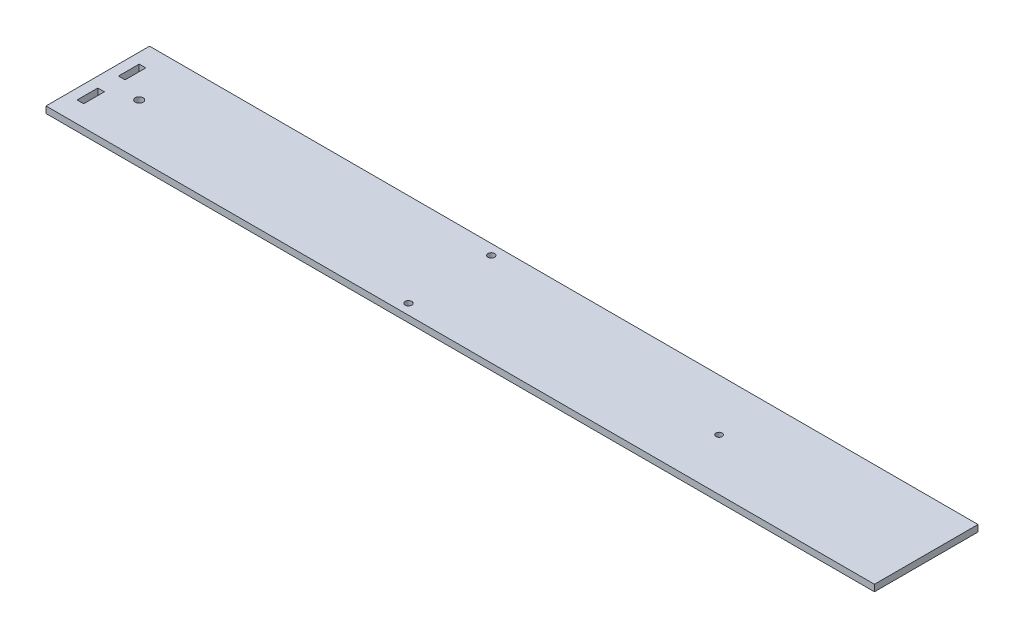
ISO-10303-21;
HEADER;
FILE_DESCRIPTION(('STEP AP214'),'2;1');
FILE_NAME('part.step','',(''),(''),'','','');
FILE_SCHEMA(('AUTOMOTIVE_DESIGN { 1 0 10303 214 1 1 1 1 }'));
ENDSEC;
DATA;
#1=APPLICATION_CONTEXT('core data for automotive mechanical design processes');
#2=APPLICATION_PROTOCOL_DEFINITION('international standard','automotive_design',2000,#1);
#3=PRODUCT_CONTEXT('',#1,'mechanical');
#4=PRODUCT('Part','Part','',(#3));
#5=PRODUCT_RELATED_PRODUCT_CATEGORY('part','',(#4));
#6=PRODUCT_DEFINITION_FORMATION('','',#4);
#7=PRODUCT_DEFINITION_CONTEXT('part definition',#1,'design');
#8=PRODUCT_DEFINITION('design','',#6,#7);
#9=PRODUCT_DEFINITION_SHAPE('','',#8);
#10=(LENGTH_UNIT() NAMED_UNIT(*) SI_UNIT(.MILLI.,.METRE.));
#11=(NAMED_UNIT(*) PLANE_ANGLE_UNIT() SI_UNIT($,.RADIAN.));
#12=(NAMED_UNIT(*) SI_UNIT($,.STERADIAN.) SOLID_ANGLE_UNIT());
#13=UNCERTAINTY_MEASURE_WITH_UNIT(LENGTH_MEASURE(1.E-05),#10,'distance_accuracy_value','');
#14=(GEOMETRIC_REPRESENTATION_CONTEXT(3) GLOBAL_UNCERTAINTY_ASSIGNED_CONTEXT((#13)) GLOBAL_UNIT_ASSIGNED_CONTEXT((#10,
#11,#12)) REPRESENTATION_CONTEXT('',''));
#15=CARTESIAN_POINT('',(0.,0.,0.));
#16=DIRECTION('',(0.,0.,1.));
#17=DIRECTION('',(1.,0.,0.));
#18=AXIS2_PLACEMENT_3D('',#15,#16,#17);
#19=CARTESIAN_POINT('',(0.,3.175,0.));
#20=DIRECTION('',(0.,-1.,0.));
#21=DIRECTION('',(0.,0.,-1.));
#22=AXIS2_PLACEMENT_3D('',#19,#20,#21);
#23=PLANE('',#22);
#24=CARTESIAN_POINT('',(300.,3.175,-25.));
#25=DIRECTION('',(0.,1.,0.));
#26=DIRECTION('',(0.,0.,1.));
#27=AXIS2_PLACEMENT_3D('',#24,#25,#26);
#28=CIRCLE('',#27,1.50000000000003);
#29=CARTESIAN_POINT('',(300.,3.175,-23.5));
#30=VERTEX_POINT('',#29);
#31=EDGE_CURVE('E162',#30,#30,#28,.T.);
#32=ORIENTED_EDGE('',*,*,#31,.F.);
#33=EDGE_LOOP('',(#32));
#34=FACE_BOUND('',#33,.T.);
#35=DIRECTION('',(0.,0.,1.));
#36=VECTOR('',#35,1.);
#37=CARTESIAN_POINT('',(5.,3.175,-20.));
#38=LINE('',#37,#36);
#39=CARTESIAN_POINT('',(5.,3.175,-20.));
#40=VERTEX_POINT('',#39);
#41=CARTESIAN_POINT('',(5.,3.175,-10.));
#42=VERTEX_POINT('',#41);
#43=EDGE_CURVE('E168',#40,#42,#38,.T.);
#44=ORIENTED_EDGE('',*,*,#43,.F.);
#45=DIRECTION('',(-1.,0.,0.));
#46=VECTOR('',#45,1.);
#47=CARTESIAN_POINT('',(8.175,3.175,-20.));
#48=LINE('',#47,#46);
#49=CARTESIAN_POINT('',(8.175,3.175,-20.));
#50=VERTEX_POINT('',#49);
#51=EDGE_CURVE('E176',#50,#40,#48,.T.);
#52=ORIENTED_EDGE('',*,*,#51,.F.);
#53=DIRECTION('',(0.,0.,-1.));
#54=VECTOR('',#53,1.);
#55=CARTESIAN_POINT('',(8.175,3.175,-10.));
#56=LINE('',#55,#54);
#57=CARTESIAN_POINT('',(8.175,3.175,-10.));
#58=VERTEX_POINT('',#57);
#59=EDGE_CURVE('E173',#58,#50,#56,.T.);
#60=ORIENTED_EDGE('',*,*,#59,.F.);
#61=DIRECTION('',(1.,0.,0.));
#62=VECTOR('',#61,1.);
#63=CARTESIAN_POINT('',(5.,3.175,-10.));
#64=LINE('',#63,#62);
#65=EDGE_CURVE('E170',#42,#58,#64,.T.);
#66=ORIENTED_EDGE('',*,*,#65,.F.);
#67=EDGE_LOOP('',(#44,#52,#60,#66));
#68=FACE_BOUND('',#67,.T.);
#69=DIRECTION('',(0.,0.,1.));
#70=VECTOR('',#69,1.);
#71=CARTESIAN_POINT('',(0.,3.175,0.));
#72=LINE('',#71,#70);
#73=CARTESIAN_POINT('',(0.,3.175,-50.));
#74=VERTEX_POINT('',#73);
#75=CARTESIAN_POINT('',(0.,3.175,0.));
#76=VERTEX_POINT('',#75);
#77=EDGE_CURVE('E199',#74,#76,#72,.T.);
#78=ORIENTED_EDGE('',*,*,#77,.T.);
#79=DIRECTION('',(1.,0.,0.));
#80=VECTOR('',#79,1.);
#81=CARTESIAN_POINT('',(0.,3.175,0.));
#82=LINE('',#81,#80);
#83=CARTESIAN_POINT('',(400.,3.175,0.));
#84=VERTEX_POINT('',#83);
#85=EDGE_CURVE('E202',#76,#84,#82,.T.);
#86=ORIENTED_EDGE('',*,*,#85,.T.);
#87=DIRECTION('',(0.,0.,-1.));
#88=VECTOR('',#87,1.);
#89=CARTESIAN_POINT('',(400.,3.175,0.));
#90=LINE('',#89,#88);
#91=CARTESIAN_POINT('',(400.,3.175,-50.));
#92=VERTEX_POINT('',#91);
#93=EDGE_CURVE('E205',#84,#92,#90,.T.);
#94=ORIENTED_EDGE('',*,*,#93,.T.);
#95=DIRECTION('',(-1.,0.,0.));
#96=VECTOR('',#95,1.);
#97=CARTESIAN_POINT('',(0.,3.175,-50.));
#98=LINE('',#97,#96);
#99=EDGE_CURVE('E207',#92,#74,#98,.T.);
#100=ORIENTED_EDGE('',*,*,#99,.T.);
#101=EDGE_LOOP('',(#78,#86,#94,#100));
#102=FACE_BOUND('',#101,.T.);
#103=DIRECTION('',(0.,0.,1.));
#104=VECTOR('',#103,1.);
#105=CARTESIAN_POINT('',(4.99999999999993,3.175,-40.));
#106=LINE('',#105,#104);
#107=CARTESIAN_POINT('',(4.99999999999993,3.175,-40.));
#108=VERTEX_POINT('',#107);
#109=CARTESIAN_POINT('',(4.99999999999993,3.175,-30.));
#110=VERTEX_POINT('',#109);
#111=EDGE_CURVE('E123',#108,#110,#106,.T.);
#112=ORIENTED_EDGE('',*,*,#111,.F.);
#113=DIRECTION('',(-1.,0.,0.));
#114=VECTOR('',#113,1.);
#115=CARTESIAN_POINT('',(8.17499999999993,3.175,-40.));
#116=LINE('',#115,#114);
#117=CARTESIAN_POINT('',(8.17499999999993,3.175,-40.));
#118=VERTEX_POINT('',#117);
#119=EDGE_CURVE('E146',#118,#108,#116,.T.);
#120=ORIENTED_EDGE('',*,*,#119,.F.);
#121=DIRECTION('',(0.,0.,-1.));
#122=VECTOR('',#121,1.);
#123=CARTESIAN_POINT('',(8.17499999999993,3.175,-30.));
#124=LINE('',#123,#122);
#125=CARTESIAN_POINT('',(8.17499999999993,3.175,-30.));
#126=VERTEX_POINT('',#125);
#127=EDGE_CURVE('E144',#126,#118,#124,.T.);
#128=ORIENTED_EDGE('',*,*,#127,.F.);
#129=DIRECTION('',(1.,0.,0.));
#130=VECTOR('',#129,1.);
#131=CARTESIAN_POINT('',(4.99999999999993,3.175,-30.));
#132=LINE('',#131,#130);
#133=EDGE_CURVE('E131',#110,#126,#132,.T.);
#134=ORIENTED_EDGE('',*,*,#133,.F.);
#135=EDGE_LOOP('',(#112,#120,#128,#134));
#136=FACE_BOUND('',#135,.T.);
#137=CARTESIAN_POINT('',(170.,3.175,-45.));
#138=DIRECTION('',(0.,1.,0.));
#139=DIRECTION('',(0.,0.,1.));
#140=AXIS2_PLACEMENT_3D('',#137,#138,#139);
#141=CIRCLE('',#140,1.59999999999999);
#142=CARTESIAN_POINT('',(170.,3.175,-43.4));
#143=VERTEX_POINT('',#142);
#144=EDGE_CURVE('E152',#143,#143,#141,.T.);
#145=ORIENTED_EDGE('',*,*,#144,.F.);
#146=EDGE_LOOP('',(#145));
#147=FACE_BOUND('',#146,.T.);
#148=CARTESIAN_POINT('',(170.,3.175,-5.));
#149=DIRECTION('',(0.,1.,0.));
#150=DIRECTION('',(0.,0.,1.));
#151=AXIS2_PLACEMENT_3D('',#148,#149,#150);
#152=CIRCLE('',#151,1.59999999999999);
#153=CARTESIAN_POINT('',(170.,3.175,-3.40000000000001));
#154=VERTEX_POINT('',#153);
#155=EDGE_CURVE('E334',#154,#154,#152,.T.);
#156=ORIENTED_EDGE('',*,*,#155,.F.);
#157=EDGE_LOOP('',(#156));
#158=FACE_BOUND('',#157,.T.);
#159=CARTESIAN_POINT('',(20.,3.175,-25.));
#160=DIRECTION('',(0.,1.,0.));
#161=DIRECTION('',(0.,0.,1.));
#162=AXIS2_PLACEMENT_3D('',#159,#160,#161);
#163=CIRCLE('',#162,1.9);
#164=CARTESIAN_POINT('',(20.,3.175,-23.1));
#165=VERTEX_POINT('',#164);
#166=EDGE_CURVE('E325',#165,#165,#163,.T.);
#167=ORIENTED_EDGE('',*,*,#166,.F.);
#168=EDGE_LOOP('',(#167));
#169=FACE_BOUND('',#168,.T.);
#170=ADVANCED_FACE('F34',(#34,#68,#102,#136,#147,#158,#169),#23,.F.);
#171=CARTESIAN_POINT('',(0.,0.,0.));
#172=DIRECTION('',(0.,-1.,0.));
#173=DIRECTION('',(0.,0.,-1.));
#174=AXIS2_PLACEMENT_3D('',#171,#172,#173);
#175=PLANE('',#174);
#176=CARTESIAN_POINT('',(170.,0.,-5.));
#177=DIRECTION('',(0.,1.,0.));
#178=DIRECTION('',(0.,0.,1.));
#179=AXIS2_PLACEMENT_3D('',#176,#177,#178);
#180=CIRCLE('',#179,1.59999999999999);
#181=CARTESIAN_POINT('',(170.,0.,-3.40000000000001));
#182=VERTEX_POINT('',#181);
#183=EDGE_CURVE('E331',#182,#182,#180,.T.);
#184=ORIENTED_EDGE('',*,*,#183,.T.);
#185=EDGE_LOOP('',(#184));
#186=FACE_BOUND('',#185,.T.);
#187=DIRECTION('',(-1.,0.,0.));
#188=VECTOR('',#187,1.);
#189=CARTESIAN_POINT('',(8.17499999999993,0.,-40.));
#190=LINE('',#189,#188);
#191=CARTESIAN_POINT('',(8.17499999999993,0.,-40.));
#192=VERTEX_POINT('',#191);
#193=CARTESIAN_POINT('',(4.99999999999993,0.,-40.));
#194=VERTEX_POINT('',#193);
#195=EDGE_CURVE('E132',#192,#194,#190,.T.);
#196=ORIENTED_EDGE('',*,*,#195,.T.);
#197=DIRECTION('',(0.,0.,1.));
#198=VECTOR('',#197,1.);
#199=CARTESIAN_POINT('',(4.99999999999993,0.,-40.));
#200=LINE('',#199,#198);
#201=CARTESIAN_POINT('',(4.99999999999993,0.,-30.));
#202=VERTEX_POINT('',#201);
#203=EDGE_CURVE('E57',#194,#202,#200,.T.);
#204=ORIENTED_EDGE('',*,*,#203,.T.);
#205=DIRECTION('',(1.,0.,0.));
#206=VECTOR('',#205,1.);
#207=CARTESIAN_POINT('',(4.99999999999993,0.,-30.));
#208=LINE('',#207,#206);
#209=CARTESIAN_POINT('',(8.17499999999993,0.,-30.));
#210=VERTEX_POINT('',#209);
#211=EDGE_CURVE('E138',#202,#210,#208,.T.);
#212=ORIENTED_EDGE('',*,*,#211,.T.);
#213=DIRECTION('',(0.,0.,-1.));
#214=VECTOR('',#213,1.);
#215=CARTESIAN_POINT('',(8.17499999999993,0.,-30.));
#216=LINE('',#215,#214);
#217=EDGE_CURVE('E154',#210,#192,#216,.T.);
#218=ORIENTED_EDGE('',*,*,#217,.T.);
#219=EDGE_LOOP('',(#196,#204,#212,#218));
#220=FACE_BOUND('',#219,.T.);
#221=CARTESIAN_POINT('',(300.,0.,-25.));
#222=DIRECTION('',(0.,1.,0.));
#223=DIRECTION('',(0.,0.,1.));
#224=AXIS2_PLACEMENT_3D('',#221,#222,#223);
#225=CIRCLE('',#224,1.50000000000003);
#226=CARTESIAN_POINT('',(300.,0.,-23.5));
#227=VERTEX_POINT('',#226);
#228=EDGE_CURVE('E139',#227,#227,#225,.T.);
#229=ORIENTED_EDGE('',*,*,#228,.T.);
#230=EDGE_LOOP('',(#229));
#231=FACE_BOUND('',#230,.T.);
#232=DIRECTION('',(0.,0.,1.));
#233=VECTOR('',#232,1.);
#234=CARTESIAN_POINT('',(0.,0.,0.));
#235=LINE('',#234,#233);
#236=CARTESIAN_POINT('',(0.,0.,-50.));
#237=VERTEX_POINT('',#236);
#238=CARTESIAN_POINT('',(0.,0.,0.));
#239=VERTEX_POINT('',#238);
#240=EDGE_CURVE('E198',#237,#239,#235,.T.);
#241=ORIENTED_EDGE('',*,*,#240,.F.);
#242=DIRECTION('',(-1.,0.,0.));
#243=VECTOR('',#242,1.);
#244=CARTESIAN_POINT('',(0.,0.,-50.));
#245=LINE('',#244,#243);
#246=CARTESIAN_POINT('',(400.,0.,-50.));
#247=VERTEX_POINT('',#246);
#248=EDGE_CURVE('E203',#247,#237,#245,.T.);
#249=ORIENTED_EDGE('',*,*,#248,.F.);
#250=DIRECTION('',(0.,0.,-1.));
#251=VECTOR('',#250,1.);
#252=CARTESIAN_POINT('',(400.,0.,0.));
#253=LINE('',#252,#251);
#254=CARTESIAN_POINT('',(400.,0.,0.));
#255=VERTEX_POINT('',#254);
#256=EDGE_CURVE('E214',#255,#247,#253,.T.);
#257=ORIENTED_EDGE('',*,*,#256,.F.);
#258=DIRECTION('',(1.,0.,0.));
#259=VECTOR('',#258,1.);
#260=CARTESIAN_POINT('',(0.,0.,0.));
#261=LINE('',#260,#259);
#262=EDGE_CURVE('E212',#239,#255,#261,.T.);
#263=ORIENTED_EDGE('',*,*,#262,.F.);
#264=EDGE_LOOP('',(#241,#249,#257,#263));
#265=FACE_BOUND('',#264,.T.);
#266=DIRECTION('',(-1.,0.,0.));
#267=VECTOR('',#266,1.);
#268=CARTESIAN_POINT('',(8.175,0.,-20.));
#269=LINE('',#268,#267);
#270=CARTESIAN_POINT('',(8.175,0.,-20.));
#271=VERTEX_POINT('',#270);
#272=CARTESIAN_POINT('',(5.,0.,-20.));
#273=VERTEX_POINT('',#272);
#274=EDGE_CURVE('E171',#271,#273,#269,.T.);
#275=ORIENTED_EDGE('',*,*,#274,.T.);
#276=DIRECTION('',(0.,0.,1.));
#277=VECTOR('',#276,1.);
#278=CARTESIAN_POINT('',(5.,0.,-20.));
#279=LINE('',#278,#277);
#280=CARTESIAN_POINT('',(5.,0.,-10.));
#281=VERTEX_POINT('',#280);
#282=EDGE_CURVE('E165',#273,#281,#279,.T.);
#283=ORIENTED_EDGE('',*,*,#282,.T.);
#284=DIRECTION('',(1.,0.,0.));
#285=VECTOR('',#284,1.);
#286=CARTESIAN_POINT('',(5.,0.,-10.));
#287=LINE('',#286,#285);
#288=CARTESIAN_POINT('',(8.175,0.,-10.));
#289=VERTEX_POINT('',#288);
#290=EDGE_CURVE('E181',#281,#289,#287,.T.);
#291=ORIENTED_EDGE('',*,*,#290,.T.);
#292=DIRECTION('',(0.,0.,-1.));
#293=VECTOR('',#292,1.);
#294=CARTESIAN_POINT('',(8.175,0.,-10.));
#295=LINE('',#294,#293);
#296=EDGE_CURVE('E184',#289,#271,#295,.T.);
#297=ORIENTED_EDGE('',*,*,#296,.T.);
#298=EDGE_LOOP('',(#275,#283,#291,#297));
#299=FACE_BOUND('',#298,.T.);
#300=CARTESIAN_POINT('',(170.,0.,-45.));
#301=DIRECTION('',(0.,1.,0.));
#302=DIRECTION('',(0.,0.,1.));
#303=AXIS2_PLACEMENT_3D('',#300,#301,#302);
#304=CIRCLE('',#303,1.59999999999999);
#305=CARTESIAN_POINT('',(170.,0.,-43.4));
#306=VERTEX_POINT('',#305);
#307=EDGE_CURVE('E337',#306,#306,#304,.T.);
#308=ORIENTED_EDGE('',*,*,#307,.T.);
#309=EDGE_LOOP('',(#308));
#310=FACE_BOUND('',#309,.T.);
#311=CARTESIAN_POINT('',(20.,0.,-25.));
#312=DIRECTION('',(0.,1.,0.));
#313=DIRECTION('',(0.,0.,1.));
#314=AXIS2_PLACEMENT_3D('',#311,#312,#313);
#315=CIRCLE('',#314,1.9);
#316=CARTESIAN_POINT('',(20.,0.,-23.1));
#317=VERTEX_POINT('',#316);
#318=EDGE_CURVE('E328',#317,#317,#315,.T.);
#319=ORIENTED_EDGE('',*,*,#318,.T.);
#320=EDGE_LOOP('',(#319));
#321=FACE_BOUND('',#320,.T.);
#322=ADVANCED_FACE('F232',(#186,#220,#231,#265,#299,#310,#321),#175,.T.);
#323=CARTESIAN_POINT('',(0.,3.175,0.));
#324=DIRECTION('',(1.,0.,0.));
#325=DIRECTION('',(0.,0.,-1.));
#326=AXIS2_PLACEMENT_3D('',#323,#324,#325);
#327=PLANE('',#326);
#328=ORIENTED_EDGE('',*,*,#240,.T.);
#329=DIRECTION('',(0.,-1.,0.));
#330=VECTOR('',#329,1.);
#331=CARTESIAN_POINT('',(0.,3.175,0.));
#332=LINE('',#331,#330);
#333=EDGE_CURVE('E11',#76,#239,#332,.T.);
#334=ORIENTED_EDGE('',*,*,#333,.F.);
#335=ORIENTED_EDGE('',*,*,#77,.F.);
#336=DIRECTION('',(0.,-1.,0.));
#337=VECTOR('',#336,1.);
#338=CARTESIAN_POINT('',(0.,3.175,-50.));
#339=LINE('',#338,#337);
#340=EDGE_CURVE('E209',#74,#237,#339,.T.);
#341=ORIENTED_EDGE('',*,*,#340,.T.);
#342=EDGE_LOOP('',(#328,#334,#335,#341));
#343=FACE_BOUND('',#342,.T.);
#344=ADVANCED_FACE('F36',(#343),#327,.F.);
#345=CARTESIAN_POINT('',(0.,3.175,0.));
#346=DIRECTION('',(0.,0.,-1.));
#347=DIRECTION('',(-1.,0.,0.));
#348=AXIS2_PLACEMENT_3D('',#345,#346,#347);
#349=PLANE('',#348);
#350=ORIENTED_EDGE('',*,*,#262,.T.);
#351=DIRECTION('',(0.,-1.,0.));
#352=VECTOR('',#351,1.);
#353=CARTESIAN_POINT('',(400.,3.175,0.));
#354=LINE('',#353,#352);
#355=EDGE_CURVE('E42',#84,#255,#354,.T.);
#356=ORIENTED_EDGE('',*,*,#355,.F.);
#357=ORIENTED_EDGE('',*,*,#85,.F.);
#358=ORIENTED_EDGE('',*,*,#333,.T.);
#359=EDGE_LOOP('',(#350,#356,#357,#358));
#360=FACE_BOUND('',#359,.T.);
#361=ADVANCED_FACE('F242',(#360),#349,.F.);
#362=CARTESIAN_POINT('',(400.,3.175,0.));
#363=DIRECTION('',(-1.,0.,0.));
#364=DIRECTION('',(0.,0.,1.));
#365=AXIS2_PLACEMENT_3D('',#362,#363,#364);
#366=PLANE('',#365);
#367=ORIENTED_EDGE('',*,*,#256,.T.);
#368=DIRECTION('',(0.,-1.,0.));
#369=VECTOR('',#368,1.);
#370=CARTESIAN_POINT('',(400.,3.175,-50.));
#371=LINE('',#370,#369);
#372=EDGE_CURVE('E219',#92,#247,#371,.T.);
#373=ORIENTED_EDGE('',*,*,#372,.F.);
#374=ORIENTED_EDGE('',*,*,#93,.F.);
#375=ORIENTED_EDGE('',*,*,#355,.T.);
#376=EDGE_LOOP('',(#367,#373,#374,#375));
#377=FACE_BOUND('',#376,.T.);
#378=ADVANCED_FACE('F226',(#377),#366,.F.);
#379=CARTESIAN_POINT('',(0.,3.175,-50.));
#380=DIRECTION('',(0.,0.,1.));
#381=DIRECTION('',(1.,0.,0.));
#382=AXIS2_PLACEMENT_3D('',#379,#380,#381);
#383=PLANE('',#382);
#384=ORIENTED_EDGE('',*,*,#248,.T.);
#385=ORIENTED_EDGE('',*,*,#340,.F.);
#386=ORIENTED_EDGE('',*,*,#99,.F.);
#387=ORIENTED_EDGE('',*,*,#372,.T.);
#388=EDGE_LOOP('',(#384,#385,#386,#387));
#389=FACE_BOUND('',#388,.T.);
#390=ADVANCED_FACE('F236',(#389),#383,.F.);
#391=CARTESIAN_POINT('',(5.,3.175,-20.));
#392=DIRECTION('',(1.,0.,0.));
#393=DIRECTION('',(0.,0.,-1.));
#394=AXIS2_PLACEMENT_3D('',#391,#392,#393);
#395=PLANE('',#394);
#396=ORIENTED_EDGE('',*,*,#282,.F.);
#397=DIRECTION('',(0.,-1.,0.));
#398=VECTOR('',#397,1.);
#399=CARTESIAN_POINT('',(5.,3.175,-20.));
#400=LINE('',#399,#398);
#401=EDGE_CURVE('E178',#40,#273,#400,.T.);
#402=ORIENTED_EDGE('',*,*,#401,.F.);
#403=ORIENTED_EDGE('',*,*,#43,.T.);
#404=DIRECTION('',(0.,-1.,0.));
#405=VECTOR('',#404,1.);
#406=CARTESIAN_POINT('',(5.,3.175,-10.));
#407=LINE('',#406,#405);
#408=EDGE_CURVE('E195',#42,#281,#407,.T.);
#409=ORIENTED_EDGE('',*,*,#408,.T.);
#410=EDGE_LOOP('',(#396,#402,#403,#409));
#411=FACE_BOUND('',#410,.T.);
#412=ADVANCED_FACE('F260',(#411),#395,.T.);
#413=CARTESIAN_POINT('',(5.,3.175,-10.));
#414=DIRECTION('',(0.,0.,-1.));
#415=DIRECTION('',(-1.,0.,0.));
#416=AXIS2_PLACEMENT_3D('',#413,#414,#415);
#417=PLANE('',#416);
#418=ORIENTED_EDGE('',*,*,#290,.F.);
#419=ORIENTED_EDGE('',*,*,#408,.F.);
#420=ORIENTED_EDGE('',*,*,#65,.T.);
#421=DIRECTION('',(0.,-1.,0.));
#422=VECTOR('',#421,1.);
#423=CARTESIAN_POINT('',(8.175,3.175,-10.));
#424=LINE('',#423,#422);
#425=EDGE_CURVE('E193',#58,#289,#424,.T.);
#426=ORIENTED_EDGE('',*,*,#425,.T.);
#427=EDGE_LOOP('',(#418,#419,#420,#426));
#428=FACE_BOUND('',#427,.T.);
#429=ADVANCED_FACE('F267',(#428),#417,.T.);
#430=CARTESIAN_POINT('',(8.175,3.175,-10.));
#431=DIRECTION('',(-1.,0.,0.));
#432=DIRECTION('',(0.,0.,1.));
#433=AXIS2_PLACEMENT_3D('',#430,#431,#432);
#434=PLANE('',#433);
#435=ORIENTED_EDGE('',*,*,#296,.F.);
#436=ORIENTED_EDGE('',*,*,#425,.F.);
#437=ORIENTED_EDGE('',*,*,#59,.T.);
#438=DIRECTION('',(0.,-1.,0.));
#439=VECTOR('',#438,1.);
#440=CARTESIAN_POINT('',(8.175,3.175,-20.));
#441=LINE('',#440,#439);
#442=EDGE_CURVE('E191',#50,#271,#441,.T.);
#443=ORIENTED_EDGE('',*,*,#442,.T.);
#444=EDGE_LOOP('',(#435,#436,#437,#443));
#445=FACE_BOUND('',#444,.T.);
#446=ADVANCED_FACE('F272',(#445),#434,.T.);
#447=CARTESIAN_POINT('',(8.175,3.175,-20.));
#448=DIRECTION('',(0.,0.,1.));
#449=DIRECTION('',(1.,0.,0.));
#450=AXIS2_PLACEMENT_3D('',#447,#448,#449);
#451=PLANE('',#450);
#452=ORIENTED_EDGE('',*,*,#274,.F.);
#453=ORIENTED_EDGE('',*,*,#442,.F.);
#454=ORIENTED_EDGE('',*,*,#51,.T.);
#455=ORIENTED_EDGE('',*,*,#401,.T.);
#456=EDGE_LOOP('',(#452,#453,#454,#455));
#457=FACE_BOUND('',#456,.T.);
#458=ADVANCED_FACE('F279',(#457),#451,.T.);
#459=CARTESIAN_POINT('',(300.,3.175,-25.));
#460=DIRECTION('',(0.,-1.,0.));
#461=DIRECTION('',(0.,0.,-1.));
#462=AXIS2_PLACEMENT_3D('',#459,#460,#461);
#463=CYLINDRICAL_SURFACE('',#462,1.50000000000003);
#464=ORIENTED_EDGE('',*,*,#31,.T.);
#465=EDGE_LOOP('',(#464));
#466=FACE_BOUND('',#465,.T.);
#467=ORIENTED_EDGE('',*,*,#228,.F.);
#468=EDGE_LOOP('',(#467));
#469=FACE_BOUND('',#468,.T.);
#470=ADVANCED_FACE('F292',(#466,#469),#463,.F.);
#471=CARTESIAN_POINT('',(4.99999999999993,3.175,-40.));
#472=DIRECTION('',(1.,0.,0.));
#473=DIRECTION('',(0.,0.,-1.));
#474=AXIS2_PLACEMENT_3D('',#471,#472,#473);
#475=PLANE('',#474);
#476=ORIENTED_EDGE('',*,*,#203,.F.);
#477=DIRECTION('',(0.,-1.,0.));
#478=VECTOR('',#477,1.);
#479=CARTESIAN_POINT('',(4.99999999999993,3.175,-40.));
#480=LINE('',#479,#478);
#481=EDGE_CURVE('E127',#108,#194,#480,.T.);
#482=ORIENTED_EDGE('',*,*,#481,.F.);
#483=ORIENTED_EDGE('',*,*,#111,.T.);
#484=DIRECTION('',(0.,-1.,0.));
#485=VECTOR('',#484,1.);
#486=CARTESIAN_POINT('',(4.99999999999993,3.175,-30.));
#487=LINE('',#486,#485);
#488=EDGE_CURVE('E126',#110,#202,#487,.T.);
#489=ORIENTED_EDGE('',*,*,#488,.T.);
#490=EDGE_LOOP('',(#476,#482,#483,#489));
#491=FACE_BOUND('',#490,.T.);
#492=ADVANCED_FACE('F125',(#491),#475,.T.);
#493=CARTESIAN_POINT('',(4.99999999999993,3.175,-30.));
#494=DIRECTION('',(0.,0.,-1.));
#495=DIRECTION('',(-1.,0.,0.));
#496=AXIS2_PLACEMENT_3D('',#493,#494,#495);
#497=PLANE('',#496);
#498=ORIENTED_EDGE('',*,*,#211,.F.);
#499=ORIENTED_EDGE('',*,*,#488,.F.);
#500=ORIENTED_EDGE('',*,*,#133,.T.);
#501=DIRECTION('',(0.,-1.,0.));
#502=VECTOR('',#501,1.);
#503=CARTESIAN_POINT('',(8.17499999999993,3.175,-30.));
#504=LINE('',#503,#502);
#505=EDGE_CURVE('E140',#126,#210,#504,.T.);
#506=ORIENTED_EDGE('',*,*,#505,.T.);
#507=EDGE_LOOP('',(#498,#499,#500,#506));
#508=FACE_BOUND('',#507,.T.);
#509=ADVANCED_FACE('F135',(#508),#497,.T.);
#510=CARTESIAN_POINT('',(8.17499999999993,3.175,-30.));
#511=DIRECTION('',(-1.,0.,0.));
#512=DIRECTION('',(0.,0.,1.));
#513=AXIS2_PLACEMENT_3D('',#510,#511,#512);
#514=PLANE('',#513);
#515=ORIENTED_EDGE('',*,*,#217,.F.);
#516=ORIENTED_EDGE('',*,*,#505,.F.);
#517=ORIENTED_EDGE('',*,*,#127,.T.);
#518=DIRECTION('',(0.,-1.,0.));
#519=VECTOR('',#518,1.);
#520=CARTESIAN_POINT('',(8.17499999999993,3.175,-40.));
#521=LINE('',#520,#519);
#522=EDGE_CURVE('E49',#118,#192,#521,.T.);
#523=ORIENTED_EDGE('',*,*,#522,.T.);
#524=EDGE_LOOP('',(#515,#516,#517,#523));
#525=FACE_BOUND('',#524,.T.);
#526=ADVANCED_FACE('F302',(#525),#514,.T.);
#527=CARTESIAN_POINT('',(8.17499999999993,3.175,-40.));
#528=DIRECTION('',(0.,0.,1.));
#529=DIRECTION('',(1.,0.,0.));
#530=AXIS2_PLACEMENT_3D('',#527,#528,#529);
#531=PLANE('',#530);
#532=ORIENTED_EDGE('',*,*,#195,.F.);
#533=ORIENTED_EDGE('',*,*,#522,.F.);
#534=ORIENTED_EDGE('',*,*,#119,.T.);
#535=ORIENTED_EDGE('',*,*,#481,.T.);
#536=EDGE_LOOP('',(#532,#533,#534,#535));
#537=FACE_BOUND('',#536,.T.);
#538=ADVANCED_FACE('F305',(#537),#531,.T.);
#539=CARTESIAN_POINT('',(170.,3.175,-45.));
#540=DIRECTION('',(0.,-1.,0.));
#541=DIRECTION('',(0.,0.,-1.));
#542=AXIS2_PLACEMENT_3D('',#539,#540,#541);
#543=CYLINDRICAL_SURFACE('',#542,1.59999999999999);
#544=ORIENTED_EDGE('',*,*,#144,.T.);
#545=EDGE_LOOP('',(#544));
#546=FACE_BOUND('',#545,.T.);
#547=ORIENTED_EDGE('',*,*,#307,.F.);
#548=EDGE_LOOP('',(#547));
#549=FACE_BOUND('',#548,.T.);
#550=ADVANCED_FACE('F309',(#546,#549),#543,.F.);
#551=CARTESIAN_POINT('',(170.,3.175,-5.));
#552=DIRECTION('',(0.,-1.,0.));
#553=DIRECTION('',(0.,0.,-1.));
#554=AXIS2_PLACEMENT_3D('',#551,#552,#553);
#555=CYLINDRICAL_SURFACE('',#554,1.59999999999999);
#556=ORIENTED_EDGE('',*,*,#155,.T.);
#557=EDGE_LOOP('',(#556));
#558=FACE_BOUND('',#557,.T.);
#559=ORIENTED_EDGE('',*,*,#183,.F.);
#560=EDGE_LOOP('',(#559));
#561=FACE_BOUND('',#560,.T.);
#562=ADVANCED_FACE('F312',(#558,#561),#555,.F.);
#563=CARTESIAN_POINT('',(20.,3.175,-25.));
#564=DIRECTION('',(0.,-1.,0.));
#565=DIRECTION('',(0.,0.,-1.));
#566=AXIS2_PLACEMENT_3D('',#563,#564,#565);
#567=CYLINDRICAL_SURFACE('',#566,1.9);
#568=ORIENTED_EDGE('',*,*,#166,.T.);
#569=EDGE_LOOP('',(#568));
#570=FACE_BOUND('',#569,.T.);
#571=ORIENTED_EDGE('',*,*,#318,.F.);
#572=EDGE_LOOP('',(#571));
#573=FACE_BOUND('',#572,.T.);
#574=ADVANCED_FACE('F316',(#570,#573),#567,.F.);
#575=CLOSED_SHELL('',(#170,#322,#344,#361,#378,#390,#412,#429,#446,#458,#470,#492,#509,#526,
#538,#550,#562,#574));
#576=MANIFOLD_SOLID_BREP('B2',#575);
#577=ADVANCED_BREP_SHAPE_REPRESENTATION('',(#18,#576),#14);
#578=SHAPE_DEFINITION_REPRESENTATION(#9,#577);
ENDSEC;
END-ISO-10303-21;
